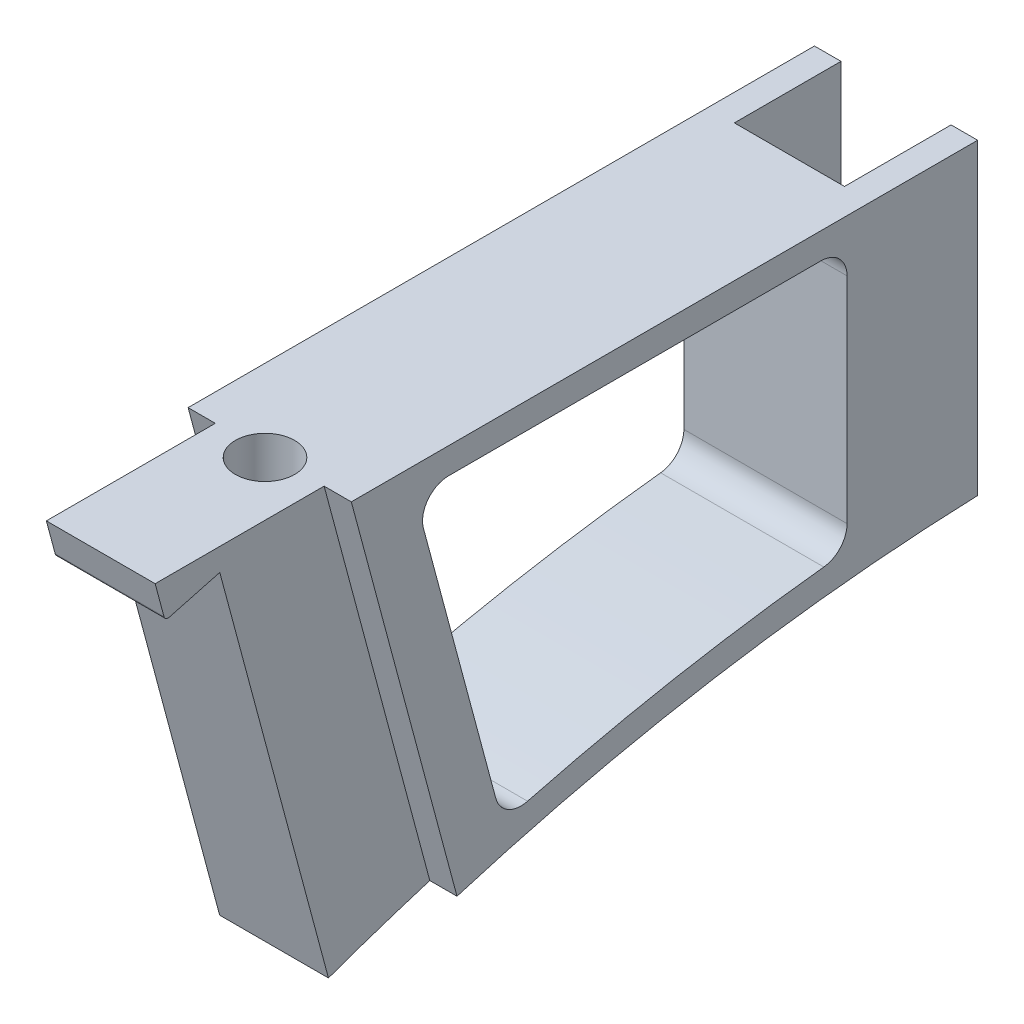
ISO-10303-21;
HEADER;
FILE_DESCRIPTION(('STEP AP214'),'2;1');
FILE_NAME('part.step','',(''),(''),'','','');
FILE_SCHEMA(('AUTOMOTIVE_DESIGN { 1 0 10303 214 1 1 1 1 }'));
ENDSEC;
DATA;
#1=APPLICATION_CONTEXT('core data for automotive mechanical design processes');
#2=APPLICATION_PROTOCOL_DEFINITION('international standard','automotive_design',2000,#1);
#3=PRODUCT_CONTEXT('',#1,'mechanical');
#4=PRODUCT('Part','Part','',(#3));
#5=PRODUCT_RELATED_PRODUCT_CATEGORY('part','',(#4));
#6=PRODUCT_DEFINITION_FORMATION('','',#4);
#7=PRODUCT_DEFINITION_CONTEXT('part definition',#1,'design');
#8=PRODUCT_DEFINITION('design','',#6,#7);
#9=PRODUCT_DEFINITION_SHAPE('','',#8);
#10=(LENGTH_UNIT() NAMED_UNIT(*) SI_UNIT(.MILLI.,.METRE.));
#11=(NAMED_UNIT(*) PLANE_ANGLE_UNIT() SI_UNIT($,.RADIAN.));
#12=(NAMED_UNIT(*) SI_UNIT($,.STERADIAN.) SOLID_ANGLE_UNIT());
#13=UNCERTAINTY_MEASURE_WITH_UNIT(LENGTH_MEASURE(1.E-05),#10,'distance_accuracy_value','');
#14=(GEOMETRIC_REPRESENTATION_CONTEXT(3) GLOBAL_UNCERTAINTY_ASSIGNED_CONTEXT((#13)) GLOBAL_UNIT_ASSIGNED_CONTEXT((#10,
#11,#12)) REPRESENTATION_CONTEXT('',''));
#15=CARTESIAN_POINT('',(0.,0.,0.));
#16=DIRECTION('',(0.,0.,1.));
#17=DIRECTION('',(1.,0.,0.));
#18=AXIS2_PLACEMENT_3D('',#15,#16,#17);
#19=CARTESIAN_POINT('',(4.7625,-136.886020449071,-28.9335540536376));
#20=DIRECTION('',(-1.,0.,0.));
#21=DIRECTION('',(0.,0.,1.));
#22=AXIS2_PLACEMENT_3D('',#19,#20,#21);
#23=CYLINDRICAL_SURFACE('',#22,119.);
#24=CARTESIAN_POINT('',(3.175,-136.886020449071,-28.9335540536376));
#25=DIRECTION('',(1.,0.,0.));
#26=DIRECTION('',(0.,0.,1.));
#27=AXIS2_PLACEMENT_3D('',#24,#25,#26);
#28=CIRCLE('',#27,119.);
#29=CARTESIAN_POINT('',(3.175,-23.0213439619458,5.64729973111368));
#30=VERTEX_POINT('',#29);
#31=CARTESIAN_POINT('',(3.175,-24.9885152456834,11.5627214449544));
#32=VERTEX_POINT('',#31);
#33=EDGE_CURVE('E268',#30,#32,#28,.T.);
#34=ORIENTED_EDGE('',*,*,#33,.T.);
#35=DIRECTION('',(1.,0.,0.));
#36=VECTOR('',#35,1.);
#37=CARTESIAN_POINT('',(-4.7625,-24.9885152456834,11.5627214449544));
#38=LINE('',#37,#36);
#39=CARTESIAN_POINT('',(-3.175,-24.9885152456834,11.5627214449544));
#40=VERTEX_POINT('',#39);
#41=EDGE_CURVE('E209',#40,#32,#38,.T.);
#42=ORIENTED_EDGE('',*,*,#41,.F.);
#43=CARTESIAN_POINT('',(-3.175,-136.886020449071,-28.9335540536376));
#44=DIRECTION('',(1.,0.,0.));
#45=DIRECTION('',(0.,0.,1.));
#46=AXIS2_PLACEMENT_3D('',#43,#44,#45);
#47=CIRCLE('',#46,119.);
#48=CARTESIAN_POINT('',(-3.175,-23.0213439619458,5.64729973111368));
#49=VERTEX_POINT('',#48);
#50=EDGE_CURVE('E247',#49,#40,#47,.T.);
#51=ORIENTED_EDGE('',*,*,#50,.F.);
#52=DIRECTION('',(-1.,0.,0.));
#53=VECTOR('',#52,1.);
#54=CARTESIAN_POINT('',(-3.175,-23.0213439619458,5.64729973111368));
#55=LINE('',#54,#53);
#56=CARTESIAN_POINT('',(-4.7625,-23.0213439619458,5.64729973111368));
#57=VERTEX_POINT('',#56);
#58=EDGE_CURVE('E259',#49,#57,#55,.T.);
#59=ORIENTED_EDGE('',*,*,#58,.T.);
#60=CARTESIAN_POINT('',(-4.7625,-136.886020449071,-28.9335540536376));
#61=DIRECTION('',(-1.,0.,0.));
#62=DIRECTION('',(0.,0.,-1.));
#63=AXIS2_PLACEMENT_3D('',#60,#61,#62);
#64=CIRCLE('',#63,119.);
#65=CARTESIAN_POINT('',(-4.7625,-17.9599388695447,-24.739854));
#66=VERTEX_POINT('',#65);
#67=EDGE_CURVE('E320',#57,#66,#64,.T.);
#68=ORIENTED_EDGE('',*,*,#67,.T.);
#69=DIRECTION('',(1.,0.,0.));
#70=VECTOR('',#69,1.);
#71=CARTESIAN_POINT('',(-24.1839645256634,-17.9599388695447,-24.739854));
#72=LINE('',#71,#70);
#73=CARTESIAN_POINT('',(-3.2131,-17.9599388695447,-24.739854));
#74=VERTEX_POINT('',#73);
#75=EDGE_CURVE('E312',#66,#74,#72,.T.);
#76=ORIENTED_EDGE('',*,*,#75,.T.);
#77=CARTESIAN_POINT('',(-3.21310000000001,-136.886020449071,-28.9335540536376));
#78=DIRECTION('',(-1.,0.,0.));
#79=DIRECTION('',(0.,-1.,0.));
#80=AXIS2_PLACEMENT_3D('',#77,#78,#79);
#81=CIRCLE('',#80,119.);
#82=CARTESIAN_POINT('',(-3.2131,-18.3428116178918,-18.516854));
#83=VERTEX_POINT('',#82);
#84=EDGE_CURVE('E290',#74,#83,#81,.F.);
#85=ORIENTED_EDGE('',*,*,#84,.T.);
#86=DIRECTION('',(-1.,0.,0.));
#87=VECTOR('',#86,1.);
#88=CARTESIAN_POINT('',(4.7625,-18.3428116178918,-18.516854));
#89=LINE('',#88,#87);
#90=CARTESIAN_POINT('',(3.2131,-18.3428116178918,-18.516854));
#91=VERTEX_POINT('',#90);
#92=EDGE_CURVE('E298',#91,#83,#89,.T.);
#93=ORIENTED_EDGE('',*,*,#92,.F.);
#94=CARTESIAN_POINT('',(3.21309999999998,-136.886020449071,-28.9335540536376));
#95=DIRECTION('',(1.,0.,0.));
#96=DIRECTION('',(0.,1.,0.));
#97=AXIS2_PLACEMENT_3D('',#94,#95,#96);
#98=CIRCLE('',#97,119.);
#99=CARTESIAN_POINT('',(3.2131,-17.9599388695447,-24.739854));
#100=VERTEX_POINT('',#99);
#101=EDGE_CURVE('E295',#91,#100,#98,.F.);
#102=ORIENTED_EDGE('',*,*,#101,.T.);
#103=CARTESIAN_POINT('',(4.7625,-17.9599388695447,-24.739854));
#104=VERTEX_POINT('',#103);
#105=EDGE_CURVE('E308',#100,#104,#72,.T.);
#106=ORIENTED_EDGE('',*,*,#105,.T.);
#107=CARTESIAN_POINT('',(4.7625,-136.886020449071,-28.9335540536376));
#108=DIRECTION('',(-1.,0.,0.));
#109=DIRECTION('',(0.,0.,-1.));
#110=AXIS2_PLACEMENT_3D('',#107,#108,#109);
#111=CIRCLE('',#110,119.);
#112=CARTESIAN_POINT('',(4.7625,-23.0213439619458,5.64729973111367));
#113=VERTEX_POINT('',#112);
#114=EDGE_CURVE('E321',#113,#104,#111,.T.);
#115=ORIENTED_EDGE('',*,*,#114,.F.);
#116=DIRECTION('',(1.,0.,0.));
#117=VECTOR('',#116,1.);
#118=CARTESIAN_POINT('',(3.175,-23.0213439619458,5.64729973111368));
#119=LINE('',#118,#117);
#120=EDGE_CURVE('E270',#30,#113,#119,.T.);
#121=ORIENTED_EDGE('',*,*,#120,.F.);
#122=EDGE_LOOP('',(#34,#42,#51,#59,#68,#76,#85,#93,#102,#106,#115,#121));
#123=FACE_BOUND('',#122,.T.);
#124=ADVANCED_FACE('F38',(#123),#23,.F.);
#125=CARTESIAN_POINT('',(4.7625,0.,18.389854));
#126=DIRECTION('',(0.,-1.,0.));
#127=DIRECTION('',(0.,0.,-1.));
#128=AXIS2_PLACEMENT_3D('',#125,#126,#127);
#129=PLANE('',#128);
#130=CARTESIAN_POINT('',(0.,0.,12.090146));
#131=DIRECTION('',(0.,1.,0.));
#132=DIRECTION('',(0.,0.,1.));
#133=AXIS2_PLACEMENT_3D('',#130,#131,#132);
#134=CIRCLE('',#133,1.7272);
#135=CARTESIAN_POINT('',(0.,0.,13.817346));
#136=VERTEX_POINT('',#135);
#137=EDGE_CURVE('E304',#136,#136,#134,.T.);
#138=ORIENTED_EDGE('',*,*,#137,.F.);
#139=EDGE_LOOP('',(#138));
#140=FACE_BOUND('',#139,.T.);
#141=DIRECTION('',(0.,0.,1.));
#142=VECTOR('',#141,1.);
#143=CARTESIAN_POINT('',(-4.7625,0.,18.389854));
#144=LINE('',#143,#142);
#145=CARTESIAN_POINT('',(-4.7625,0.,-24.739854));
#146=VERTEX_POINT('',#145);
#147=CARTESIAN_POINT('',(-4.7625,0.,11.815850254396));
#148=VERTEX_POINT('',#147);
#149=EDGE_CURVE('E324',#146,#148,#144,.T.);
#150=ORIENTED_EDGE('',*,*,#149,.T.);
#151=DIRECTION('',(-1.,0.,0.));
#152=VECTOR('',#151,1.);
#153=CARTESIAN_POINT('',(-3.175,0.,11.815850254396));
#154=LINE('',#153,#152);
#155=CARTESIAN_POINT('',(-3.175,0.,11.815850254396));
#156=VERTEX_POINT('',#155);
#157=EDGE_CURVE('E256',#156,#148,#154,.T.);
#158=ORIENTED_EDGE('',*,*,#157,.F.);
#159=DIRECTION('',(0.,0.,-1.));
#160=VECTOR('',#159,1.);
#161=CARTESIAN_POINT('',(-3.175,0.,18.389854));
#162=LINE('',#161,#160);
#163=CARTESIAN_POINT('',(-3.175,0.,21.676855872802));
#164=VERTEX_POINT('',#163);
#165=EDGE_CURVE('E253',#164,#156,#162,.T.);
#166=ORIENTED_EDGE('',*,*,#165,.F.);
#167=DIRECTION('',(1.,0.,0.));
#168=VECTOR('',#167,1.);
#169=CARTESIAN_POINT('',(-3.175,0.,21.676855872802));
#170=LINE('',#169,#168);
#171=CARTESIAN_POINT('',(3.175,0.,21.676855872802));
#172=VERTEX_POINT('',#171);
#173=EDGE_CURVE('E219',#164,#172,#170,.T.);
#174=ORIENTED_EDGE('',*,*,#173,.T.);
#175=DIRECTION('',(0.,0.,-1.));
#176=VECTOR('',#175,1.);
#177=CARTESIAN_POINT('',(3.175,0.,18.389854));
#178=LINE('',#177,#176);
#179=CARTESIAN_POINT('',(3.175,0.,11.815850254396));
#180=VERTEX_POINT('',#179);
#181=EDGE_CURVE('E263',#172,#180,#178,.T.);
#182=ORIENTED_EDGE('',*,*,#181,.T.);
#183=DIRECTION('',(1.,0.,0.));
#184=VECTOR('',#183,1.);
#185=CARTESIAN_POINT('',(3.175,0.,11.815850254396));
#186=LINE('',#185,#184);
#187=CARTESIAN_POINT('',(4.7625,0.,11.815850254396));
#188=VERTEX_POINT('',#187);
#189=EDGE_CURVE('E274',#180,#188,#186,.T.);
#190=ORIENTED_EDGE('',*,*,#189,.T.);
#191=DIRECTION('',(0.,0.,1.));
#192=VECTOR('',#191,1.);
#193=CARTESIAN_POINT('',(4.7625,0.,18.389854));
#194=LINE('',#193,#192);
#195=CARTESIAN_POINT('',(4.7625,0.,-24.739854));
#196=VERTEX_POINT('',#195);
#197=EDGE_CURVE('E323',#196,#188,#194,.T.);
#198=ORIENTED_EDGE('',*,*,#197,.F.);
#199=DIRECTION('',(1.,0.,0.));
#200=VECTOR('',#199,1.);
#201=CARTESIAN_POINT('',(-24.1839645256634,0.,-24.739854));
#202=LINE('',#201,#200);
#203=CARTESIAN_POINT('',(3.2131,0.,-24.739854));
#204=VERTEX_POINT('',#203);
#205=EDGE_CURVE('E311',#204,#196,#202,.T.);
#206=ORIENTED_EDGE('',*,*,#205,.F.);
#207=DIRECTION('',(0.,0.,-1.));
#208=VECTOR('',#207,1.);
#209=CARTESIAN_POINT('',(3.2131,0.,-18.516854));
#210=LINE('',#209,#208);
#211=CARTESIAN_POINT('',(3.2131,0.,-18.516854));
#212=VERTEX_POINT('',#211);
#213=EDGE_CURVE('E288',#212,#204,#210,.T.);
#214=ORIENTED_EDGE('',*,*,#213,.F.);
#215=DIRECTION('',(1.,0.,0.));
#216=VECTOR('',#215,1.);
#217=CARTESIAN_POINT('',(3.2131,0.,-18.516854));
#218=LINE('',#217,#216);
#219=CARTESIAN_POINT('',(-3.2131,0.,-18.516854));
#220=VERTEX_POINT('',#219);
#221=EDGE_CURVE('E283',#220,#212,#218,.T.);
#222=ORIENTED_EDGE('',*,*,#221,.F.);
#223=DIRECTION('',(0.,0.,-1.));
#224=VECTOR('',#223,1.);
#225=CARTESIAN_POINT('',(-3.2131,0.,-18.516854));
#226=LINE('',#225,#224);
#227=CARTESIAN_POINT('',(-3.2131,0.,-24.739854));
#228=VERTEX_POINT('',#227);
#229=EDGE_CURVE('E286',#220,#228,#226,.T.);
#230=ORIENTED_EDGE('',*,*,#229,.T.);
#231=EDGE_CURVE('E305',#146,#228,#202,.T.);
#232=ORIENTED_EDGE('',*,*,#231,.F.);
#233=EDGE_LOOP('',(#150,#158,#166,#174,#182,#190,#198,#206,#214,#222,#230,#232));
#234=FACE_BOUND('',#233,.T.);
#235=ADVANCED_FACE('F395',(#140,#234),#129,.F.);
#236=CARTESIAN_POINT('',(4.7625,-136.886020449071,-28.9335540536376));
#237=DIRECTION('',(1.,0.,0.));
#238=DIRECTION('',(0.,0.,-1.));
#239=AXIS2_PLACEMENT_3D('',#236,#237,#238);
#240=PLANE('',#239);
#241=DIRECTION('',(0.,-0.96592582628907,-0.258819045102514));
#242=VECTOR('',#241,1.);
#243=CARTESIAN_POINT('',(4.7625,-20.6670496227549,2.99112912524303));
#244=LINE('',#243,#242);
#245=CARTESIAN_POINT('',(4.7625,-3.44244022473624,7.60644930338352));
#246=VERTEX_POINT('',#245);
#247=CARTESIAN_POINT('',(4.7625,-19.1950079553788,3.38556150124139));
#248=VERTEX_POINT('',#247);
#249=EDGE_CURVE('E222',#246,#248,#244,.T.);
#250=ORIENTED_EDGE('',*,*,#249,.F.);
#251=CARTESIAN_POINT('',(4.7625,-3.04800000000001,6.13437834411898));
#252=DIRECTION('',(1.,0.,0.));
#253=DIRECTION('',(0.,0.,-1.));
#254=AXIS2_PLACEMENT_3D('',#251,#252,#253);
#255=CIRCLE('',#254,1.524);
#256=CARTESIAN_POINT('',(4.7625,-1.524,6.13437834411898));
#257=VERTEX_POINT('',#256);
#258=EDGE_CURVE('E364',#246,#257,#255,.F.);
#259=ORIENTED_EDGE('',*,*,#258,.T.);
#260=DIRECTION('',(0.,0.,1.));
#261=VECTOR('',#260,1.);
#262=CARTESIAN_POINT('',(4.7625,-1.524,8.12049381232896));
#263=LINE('',#262,#261);
#264=CARTESIAN_POINT('',(4.7625,-1.524,-15.595854));
#265=VERTEX_POINT('',#264);
#266=EDGE_CURVE('E231',#265,#257,#263,.T.);
#267=ORIENTED_EDGE('',*,*,#266,.F.);
#268=CARTESIAN_POINT('',(4.7625,-3.048,-15.595854));
#269=DIRECTION('',(1.,0.,0.));
#270=DIRECTION('',(0.,0.,-1.));
#271=AXIS2_PLACEMENT_3D('',#268,#269,#270);
#272=CIRCLE('',#271,1.524);
#273=CARTESIAN_POINT('',(4.7625,-3.048,-17.119854));
#274=VERTEX_POINT('',#273);
#275=EDGE_CURVE('E360',#265,#274,#272,.F.);
#276=ORIENTED_EDGE('',*,*,#275,.T.);
#277=DIRECTION('',(0.,1.,0.));
#278=VECTOR('',#277,1.);
#279=CARTESIAN_POINT('',(4.7625,-1.524,-17.119854));
#280=LINE('',#279,#278);
#281=CARTESIAN_POINT('',(4.7625,-15.5689974832926,-17.119854));
#282=VERTEX_POINT('',#281);
#283=EDGE_CURVE('E228',#282,#274,#280,.T.);
#284=ORIENTED_EDGE('',*,*,#283,.F.);
#285=CARTESIAN_POINT('',(4.7625,-15.5689974832926,-15.595854));
#286=DIRECTION('',(1.,0.,0.));
#287=DIRECTION('',(0.,0.,-1.));
#288=AXIS2_PLACEMENT_3D('',#285,#286,#287);
#289=CIRCLE('',#288,1.524);
#290=CARTESIAN_POINT('',(4.7625,-17.0838698531785,-15.7624003988082));
#291=VERTEX_POINT('',#290);
#292=EDGE_CURVE('E356',#282,#291,#289,.F.);
#293=ORIENTED_EDGE('',*,*,#292,.T.);
#294=CARTESIAN_POINT('',(4.7625,-136.886020449071,-28.9335540536376));
#295=DIRECTION('',(-1.,0.,0.));
#296=DIRECTION('',(0.,0.,-1.));
#297=AXIS2_PLACEMENT_3D('',#294,#295,#296);
#298=CIRCLE('',#297,120.524);
#299=CARTESIAN_POINT('',(4.7625,-20.2750878370178,1.52830687683105));
#300=VERTEX_POINT('',#299);
#301=EDGE_CURVE('E225',#300,#291,#298,.T.);
#302=ORIENTED_EDGE('',*,*,#301,.F.);
#303=CARTESIAN_POINT('',(4.7625,-18.8005677306426,1.91349054197685));
#304=DIRECTION('',(1.,0.,0.));
#305=DIRECTION('',(0.,0.,-1.));
#306=AXIS2_PLACEMENT_3D('',#303,#304,#305);
#307=CIRCLE('',#306,1.524);
#308=EDGE_CURVE('E352',#300,#248,#307,.F.);
#309=ORIENTED_EDGE('',*,*,#308,.T.);
#310=EDGE_LOOP('',(#250,#259,#267,#276,#284,#293,#302,#309));
#311=FACE_BOUND('',#310,.T.);
#312=ORIENTED_EDGE('',*,*,#197,.T.);
#313=DIRECTION('',(0.,-0.96592582628907,-0.258819045102514));
#314=VECTOR('',#313,1.);
#315=CARTESIAN_POINT('',(4.7625,0.,11.815850254396));
#316=LINE('',#315,#314);
#317=EDGE_CURVE('E262',#188,#113,#316,.T.);
#318=ORIENTED_EDGE('',*,*,#317,.T.);
#319=ORIENTED_EDGE('',*,*,#114,.T.);
#320=DIRECTION('',(0.,1.,0.));
#321=VECTOR('',#320,1.);
#322=CARTESIAN_POINT('',(4.7625,0.,-24.739854));
#323=LINE('',#322,#321);
#324=EDGE_CURVE('E300',#104,#196,#323,.T.);
#325=ORIENTED_EDGE('',*,*,#324,.T.);
#326=EDGE_LOOP('',(#312,#318,#319,#325));
#327=FACE_BOUND('',#326,.T.);
#328=ADVANCED_FACE('F401',(#311,#327),#240,.T.);
#329=CARTESIAN_POINT('',(-24.1839645256634,0.,-24.739854));
#330=DIRECTION('',(0.,0.,-1.));
#331=DIRECTION('',(0.,1.,0.));
#332=AXIS2_PLACEMENT_3D('',#329,#330,#331);
#333=PLANE('',#332);
#334=DIRECTION('',(0.,-1.,0.));
#335=VECTOR('',#334,1.);
#336=CARTESIAN_POINT('',(3.2131,0.,-24.739854));
#337=LINE('',#336,#335);
#338=EDGE_CURVE('E277',#204,#100,#337,.T.);
#339=ORIENTED_EDGE('',*,*,#338,.F.);
#340=ORIENTED_EDGE('',*,*,#205,.T.);
#341=ORIENTED_EDGE('',*,*,#324,.F.);
#342=ORIENTED_EDGE('',*,*,#105,.F.);
#343=EDGE_LOOP('',(#339,#340,#341,#342));
#344=FACE_BOUND('',#343,.T.);
#345=ADVANCED_FACE('F458',(#344),#333,.T.);
#346=CARTESIAN_POINT('',(-4.7625,-136.886020449071,-28.9335540536376));
#347=DIRECTION('',(1.,0.,0.));
#348=DIRECTION('',(0.,0.,-1.));
#349=AXIS2_PLACEMENT_3D('',#346,#347,#348);
#350=PLANE('',#349);
#351=DIRECTION('',(0.,1.,0.));
#352=VECTOR('',#351,1.);
#353=CARTESIAN_POINT('',(-4.7625,-1.524,-17.119854));
#354=LINE('',#353,#352);
#355=CARTESIAN_POINT('',(-4.7625,-15.5689974832926,-17.119854));
#356=VERTEX_POINT('',#355);
#357=CARTESIAN_POINT('',(-4.7625,-3.048,-17.119854));
#358=VERTEX_POINT('',#357);
#359=EDGE_CURVE('E240',#356,#358,#354,.T.);
#360=ORIENTED_EDGE('',*,*,#359,.T.);
#361=CARTESIAN_POINT('',(-4.7625,-3.048,-15.595854));
#362=DIRECTION('',(1.,0.,0.));
#363=DIRECTION('',(0.,0.,-1.));
#364=AXIS2_PLACEMENT_3D('',#361,#362,#363);
#365=CIRCLE('',#364,1.524);
#366=CARTESIAN_POINT('',(-4.7625,-1.524,-15.595854));
#367=VERTEX_POINT('',#366);
#368=EDGE_CURVE('E362',#358,#367,#365,.T.);
#369=ORIENTED_EDGE('',*,*,#368,.T.);
#370=DIRECTION('',(0.,0.,1.));
#371=VECTOR('',#370,1.);
#372=CARTESIAN_POINT('',(-4.7625,-1.524,8.12049381232896));
#373=LINE('',#372,#371);
#374=CARTESIAN_POINT('',(-4.7625,-1.524,6.13437834411898));
#375=VERTEX_POINT('',#374);
#376=EDGE_CURVE('E243',#367,#375,#373,.T.);
#377=ORIENTED_EDGE('',*,*,#376,.T.);
#378=CARTESIAN_POINT('',(-4.7625,-3.04800000000001,6.13437834411898));
#379=DIRECTION('',(1.,0.,0.));
#380=DIRECTION('',(0.,0.,-1.));
#381=AXIS2_PLACEMENT_3D('',#378,#379,#380);
#382=CIRCLE('',#381,1.524);
#383=CARTESIAN_POINT('',(-4.7625,-3.44244022473624,7.60644930338352));
#384=VERTEX_POINT('',#383);
#385=EDGE_CURVE('E366',#375,#384,#382,.T.);
#386=ORIENTED_EDGE('',*,*,#385,.T.);
#387=DIRECTION('',(0.,-0.96592582628907,-0.258819045102514));
#388=VECTOR('',#387,1.);
#389=CARTESIAN_POINT('',(-4.7625,-20.6670496227549,2.99112912524303));
#390=LINE('',#389,#388);
#391=CARTESIAN_POINT('',(-4.7625,-19.1950079553788,3.38556150124139));
#392=VERTEX_POINT('',#391);
#393=EDGE_CURVE('E234',#384,#392,#390,.T.);
#394=ORIENTED_EDGE('',*,*,#393,.T.);
#395=CARTESIAN_POINT('',(-4.7625,-18.8005677306426,1.91349054197685));
#396=DIRECTION('',(1.,0.,0.));
#397=DIRECTION('',(0.,0.,-1.));
#398=AXIS2_PLACEMENT_3D('',#395,#396,#397);
#399=CIRCLE('',#398,1.524);
#400=CARTESIAN_POINT('',(-4.7625,-20.2750878370178,1.52830687683105));
#401=VERTEX_POINT('',#400);
#402=EDGE_CURVE('E354',#392,#401,#399,.T.);
#403=ORIENTED_EDGE('',*,*,#402,.T.);
#404=CARTESIAN_POINT('',(-4.7625,-136.886020449071,-28.9335540536376));
#405=DIRECTION('',(-1.,0.,0.));
#406=DIRECTION('',(0.,0.,-1.));
#407=AXIS2_PLACEMENT_3D('',#404,#405,#406);
#408=CIRCLE('',#407,120.524);
#409=CARTESIAN_POINT('',(-4.7625,-17.0838698531785,-15.7624003988082));
#410=VERTEX_POINT('',#409);
#411=EDGE_CURVE('E237',#401,#410,#408,.T.);
#412=ORIENTED_EDGE('',*,*,#411,.T.);
#413=CARTESIAN_POINT('',(-4.7625,-15.5689974832926,-15.595854));
#414=DIRECTION('',(1.,0.,0.));
#415=DIRECTION('',(0.,0.,-1.));
#416=AXIS2_PLACEMENT_3D('',#413,#414,#415);
#417=CIRCLE('',#416,1.524);
#418=EDGE_CURVE('E358',#410,#356,#417,.T.);
#419=ORIENTED_EDGE('',*,*,#418,.T.);
#420=EDGE_LOOP('',(#360,#369,#377,#386,#394,#403,#412,#419));
#421=FACE_BOUND('',#420,.T.);
#422=ORIENTED_EDGE('',*,*,#67,.F.);
#423=DIRECTION('',(0.,-0.96592582628907,-0.258819045102514));
#424=VECTOR('',#423,1.);
#425=CARTESIAN_POINT('',(-4.7625,0.,11.815850254396));
#426=LINE('',#425,#424);
#427=EDGE_CURVE('E246',#148,#57,#426,.T.);
#428=ORIENTED_EDGE('',*,*,#427,.F.);
#429=ORIENTED_EDGE('',*,*,#149,.F.);
#430=DIRECTION('',(0.,-1.,0.));
#431=VECTOR('',#430,1.);
#432=CARTESIAN_POINT('',(-4.7625,0.,-24.739854));
#433=LINE('',#432,#431);
#434=EDGE_CURVE('E301',#146,#66,#433,.T.);
#435=ORIENTED_EDGE('',*,*,#434,.T.);
#436=EDGE_LOOP('',(#422,#428,#429,#435));
#437=FACE_BOUND('',#436,.T.);
#438=ADVANCED_FACE('F430',(#421,#437),#350,.F.);
#439=CARTESIAN_POINT('',(0.,-8.89,12.090146));
#440=DIRECTION('',(0.,1.,0.));
#441=DIRECTION('',(0.,0.,1.));
#442=AXIS2_PLACEMENT_3D('',#439,#440,#441);
#443=CONICAL_SURFACE('',#442,1.7272,1.02974425867665);
#444=CARTESIAN_POINT('',(0.,-9.9278064611844,12.090146));
#445=VERTEX_POINT('',#444);
#446=VERTEX_LOOP('',#445);
#447=FACE_BOUND('',#446,.T.);
#448=CARTESIAN_POINT('',(0.,-8.89,12.090146));
#449=DIRECTION('',(0.,1.,0.));
#450=DIRECTION('',(0.,0.,1.));
#451=AXIS2_PLACEMENT_3D('',#448,#449,#450);
#452=CIRCLE('',#451,1.7272);
#453=CARTESIAN_POINT('',(0.,-8.89,13.817346));
#454=VERTEX_POINT('',#453);
#455=EDGE_CURVE('E317',#454,#454,#452,.T.);
#456=ORIENTED_EDGE('',*,*,#455,.T.);
#457=EDGE_LOOP('',(#456));
#458=FACE_BOUND('',#457,.T.);
#459=ADVANCED_FACE('F519',(#447,#458),#443,.F.);
#460=CARTESIAN_POINT('',(0.,0.,12.090146));
#461=DIRECTION('',(0.,1.,0.));
#462=DIRECTION('',(0.,0.,1.));
#463=AXIS2_PLACEMENT_3D('',#460,#461,#462);
#464=CYLINDRICAL_SURFACE('',#463,1.7272);
#465=ORIENTED_EDGE('',*,*,#455,.F.);
#466=EDGE_LOOP('',(#465));
#467=FACE_BOUND('',#466,.T.);
#468=ORIENTED_EDGE('',*,*,#137,.T.);
#469=EDGE_LOOP('',(#468));
#470=FACE_BOUND('',#469,.T.);
#471=ADVANCED_FACE('F516',(#467,#470),#464,.F.);
#472=DIRECTION('',(0.,1.,0.));
#473=VECTOR('',#472,1.);
#474=CARTESIAN_POINT('',(-3.2131,0.,-24.739854));
#475=LINE('',#474,#473);
#476=EDGE_CURVE('E327',#74,#228,#475,.T.);
#477=ORIENTED_EDGE('',*,*,#476,.F.);
#478=ORIENTED_EDGE('',*,*,#75,.F.);
#479=ORIENTED_EDGE('',*,*,#434,.F.);
#480=ORIENTED_EDGE('',*,*,#231,.T.);
#481=EDGE_LOOP('',(#477,#478,#479,#480));
#482=FACE_BOUND('',#481,.T.);
#483=ADVANCED_FACE('F488',(#482),#333,.T.);
#484=CARTESIAN_POINT('',(3.2131,-22.225,-18.516854));
#485=DIRECTION('',(0.,0.,-1.));
#486=DIRECTION('',(0.,1.,0.));
#487=AXIS2_PLACEMENT_3D('',#484,#485,#486);
#488=PLANE('',#487);
#489=ORIENTED_EDGE('',*,*,#92,.T.);
#490=DIRECTION('',(0.,1.,0.));
#491=VECTOR('',#490,1.);
#492=CARTESIAN_POINT('',(-3.2131,0.,-18.516854));
#493=LINE('',#492,#491);
#494=EDGE_CURVE('E281',#83,#220,#493,.T.);
#495=ORIENTED_EDGE('',*,*,#494,.T.);
#496=ORIENTED_EDGE('',*,*,#221,.T.);
#497=DIRECTION('',(0.,-1.,0.));
#498=VECTOR('',#497,1.);
#499=CARTESIAN_POINT('',(3.2131,0.,-18.516854));
#500=LINE('',#499,#498);
#501=EDGE_CURVE('E278',#212,#91,#500,.T.);
#502=ORIENTED_EDGE('',*,*,#501,.T.);
#503=EDGE_LOOP('',(#489,#495,#496,#502));
#504=FACE_BOUND('',#503,.T.);
#505=ADVANCED_FACE('F481',(#504),#488,.T.);
#506=CARTESIAN_POINT('',(3.2131,0.,-18.516854));
#507=DIRECTION('',(1.,0.,0.));
#508=DIRECTION('',(0.,1.,0.));
#509=AXIS2_PLACEMENT_3D('',#506,#507,#508);
#510=PLANE('',#509);
#511=ORIENTED_EDGE('',*,*,#501,.F.);
#512=ORIENTED_EDGE('',*,*,#213,.T.);
#513=ORIENTED_EDGE('',*,*,#338,.T.);
#514=ORIENTED_EDGE('',*,*,#101,.F.);
#515=EDGE_LOOP('',(#511,#512,#513,#514));
#516=FACE_BOUND('',#515,.T.);
#517=ADVANCED_FACE('F476',(#516),#510,.F.);
#518=CARTESIAN_POINT('',(-3.2131,0.,-18.516854));
#519=DIRECTION('',(-1.,0.,0.));
#520=DIRECTION('',(0.,-1.,0.));
#521=AXIS2_PLACEMENT_3D('',#518,#519,#520);
#522=PLANE('',#521);
#523=ORIENTED_EDGE('',*,*,#476,.T.);
#524=ORIENTED_EDGE('',*,*,#229,.F.);
#525=ORIENTED_EDGE('',*,*,#494,.F.);
#526=ORIENTED_EDGE('',*,*,#84,.F.);
#527=EDGE_LOOP('',(#523,#524,#525,#526));
#528=FACE_BOUND('',#527,.T.);
#529=ADVANCED_FACE('F484',(#528),#522,.F.);
#530=CARTESIAN_POINT('',(3.175,0.,11.815850254396));
#531=DIRECTION('',(0.,-0.258819045102514,0.96592582628907));
#532=DIRECTION('',(0.,-0.96592582628907,-0.258819045102514));
#533=AXIS2_PLACEMENT_3D('',#530,#531,#532);
#534=PLANE('',#533);
#535=ORIENTED_EDGE('',*,*,#317,.F.);
#536=ORIENTED_EDGE('',*,*,#189,.F.);
#537=DIRECTION('',(0.,-0.96592582628907,-0.258819045102514));
#538=VECTOR('',#537,1.);
#539=CARTESIAN_POINT('',(3.175,0.,11.815850254396));
#540=LINE('',#539,#538);
#541=EDGE_CURVE('E266',#180,#30,#540,.T.);
#542=ORIENTED_EDGE('',*,*,#541,.T.);
#543=ORIENTED_EDGE('',*,*,#120,.T.);
#544=EDGE_LOOP('',(#535,#536,#542,#543));
#545=FACE_BOUND('',#544,.T.);
#546=ADVANCED_FACE('F468',(#545),#534,.T.);
#547=CARTESIAN_POINT('',(3.175,-136.886020449071,-28.9335540536376));
#548=DIRECTION('',(-1.,0.,0.));
#549=DIRECTION('',(0.,0.,1.));
#550=AXIS2_PLACEMENT_3D('',#547,#548,#549);
#551=PLANE('',#550);
#552=DIRECTION('',(0.,0.258819045102515,-0.96592582628907));
#553=VECTOR('',#552,1.);
#554=CARTESIAN_POINT('',(3.175,-2.17114884752631,21.0950982924596));
#555=LINE('',#554,#553);
#556=CARTESIAN_POINT('',(3.175,-2.10540881007028,20.8497531325822));
#557=VERTEX_POINT('',#556);
#558=CARTESIAN_POINT('',(3.175,-1.31652836059781,17.9056112140531));
#559=VERTEX_POINT('',#558);
#560=EDGE_CURVE('E194',#557,#559,#555,.T.);
#561=ORIENTED_EDGE('',*,*,#560,.T.);
#562=DIRECTION('',(0.,0.96592582628907,0.258819045102515));
#563=VECTOR('',#562,1.);
#564=CARTESIAN_POINT('',(3.175,-24.9885152456833,11.5627214449544));
#565=LINE('',#564,#563);
#566=EDGE_CURVE('E199',#32,#559,#565,.T.);
#567=ORIENTED_EDGE('',*,*,#566,.F.);
#568=ORIENTED_EDGE('',*,*,#33,.F.);
#569=ORIENTED_EDGE('',*,*,#541,.F.);
#570=ORIENTED_EDGE('',*,*,#181,.F.);
#571=DIRECTION('',(0.,-0.96592582628907,-0.258819045102514));
#572=VECTOR('',#571,1.);
#573=CARTESIAN_POINT('',(3.175,0.,21.676855872802));
#574=LINE('',#573,#572);
#575=CARTESIAN_POINT('',(3.175,-1.92580368764889,21.1608383299156));
#576=VERTEX_POINT('',#575);
#577=EDGE_CURVE('E202',#172,#576,#574,.T.);
#578=ORIENTED_EDGE('',*,*,#577,.T.);
#579=CARTESIAN_POINT('',(3.175,-1.86006365019285,20.9154931700382));
#580=DIRECTION('',(-1.,0.,0.));
#581=DIRECTION('',(0.,0.,1.));
#582=AXIS2_PLACEMENT_3D('',#579,#580,#581);
#583=CIRCLE('',#582,0.254);
#584=EDGE_CURVE('E61',#576,#557,#583,.F.);
#585=ORIENTED_EDGE('',*,*,#584,.T.);
#586=EDGE_LOOP('',(#561,#567,#568,#569,#570,#578,#585));
#587=FACE_BOUND('',#586,.T.);
#588=ADVANCED_FACE('F196',(#587),#551,.F.);
#589=CARTESIAN_POINT('',(-3.175,0.,11.815850254396));
#590=DIRECTION('',(0.,0.258819045102514,-0.96592582628907));
#591=DIRECTION('',(0.,0.96592582628907,0.258819045102514));
#592=AXIS2_PLACEMENT_3D('',#589,#590,#591);
#593=PLANE('',#592);
#594=ORIENTED_EDGE('',*,*,#427,.T.);
#595=ORIENTED_EDGE('',*,*,#58,.F.);
#596=DIRECTION('',(0.,-0.96592582628907,-0.258819045102514));
#597=VECTOR('',#596,1.);
#598=CARTESIAN_POINT('',(-3.175,0.,11.815850254396));
#599=LINE('',#598,#597);
#600=EDGE_CURVE('E250',#156,#49,#599,.T.);
#601=ORIENTED_EDGE('',*,*,#600,.F.);
#602=ORIENTED_EDGE('',*,*,#157,.T.);
#603=EDGE_LOOP('',(#594,#595,#601,#602));
#604=FACE_BOUND('',#603,.T.);
#605=ADVANCED_FACE('F495',(#604),#593,.F.);
#606=CARTESIAN_POINT('',(-3.175,-136.886020449071,-28.9335540536376));
#607=DIRECTION('',(1.,0.,0.));
#608=DIRECTION('',(0.,0.,1.));
#609=AXIS2_PLACEMENT_3D('',#606,#607,#608);
#610=PLANE('',#609);
#611=ORIENTED_EDGE('',*,*,#50,.T.);
#612=DIRECTION('',(0.,0.96592582628907,0.258819045102515));
#613=VECTOR('',#612,1.);
#614=CARTESIAN_POINT('',(-3.175,-139.514377785143,-19.1243909349708));
#615=LINE('',#614,#613);
#616=CARTESIAN_POINT('',(-3.175,-1.31652836059781,17.9056112140531));
#617=VERTEX_POINT('',#616);
#618=EDGE_CURVE('E11',#40,#617,#615,.T.);
#619=ORIENTED_EDGE('',*,*,#618,.T.);
#620=DIRECTION('',(0.,0.258819045102515,-0.96592582628907));
#621=VECTOR('',#620,1.);
#622=CARTESIAN_POINT('',(-3.175,-2.17114884752631,21.0950982924596));
#623=LINE('',#622,#621);
#624=CARTESIAN_POINT('',(-3.175,-2.10540881007028,20.8497531325822));
#625=VERTEX_POINT('',#624);
#626=EDGE_CURVE('E207',#625,#617,#623,.T.);
#627=ORIENTED_EDGE('',*,*,#626,.F.);
#628=CARTESIAN_POINT('',(-3.175,-1.86006365019285,20.9154931700382));
#629=DIRECTION('',(1.,0.,0.));
#630=DIRECTION('',(0.,0.,-1.));
#631=AXIS2_PLACEMENT_3D('',#628,#629,#630);
#632=CIRCLE('',#631,0.254);
#633=CARTESIAN_POINT('',(-3.175,-1.92580368764889,21.1608383299156));
#634=VERTEX_POINT('',#633);
#635=EDGE_CURVE('E46',#625,#634,#632,.F.);
#636=ORIENTED_EDGE('',*,*,#635,.T.);
#637=DIRECTION('',(0.,-0.96592582628907,-0.258819045102514));
#638=VECTOR('',#637,1.);
#639=CARTESIAN_POINT('',(-3.175,0.,21.676855872802));
#640=LINE('',#639,#638);
#641=EDGE_CURVE('E201',#164,#634,#640,.T.);
#642=ORIENTED_EDGE('',*,*,#641,.F.);
#643=ORIENTED_EDGE('',*,*,#165,.T.);
#644=ORIENTED_EDGE('',*,*,#600,.T.);
#645=EDGE_LOOP('',(#611,#619,#627,#636,#642,#643,#644));
#646=FACE_BOUND('',#645,.T.);
#647=ADVANCED_FACE('F379',(#646),#610,.F.);
#648=CARTESIAN_POINT('',(-4.7625,-20.6670496227549,2.99112912524303));
#649=DIRECTION('',(0.,-0.258819045102514,0.96592582628907));
#650=DIRECTION('',(0.,-0.96592582628907,-0.258819045102514));
#651=AXIS2_PLACEMENT_3D('',#648,#649,#650);
#652=PLANE('',#651);
#653=ORIENTED_EDGE('',*,*,#249,.T.);
#654=DIRECTION('',(-1.,0.,0.));
#655=VECTOR('',#654,1.);
#656=CARTESIAN_POINT('',(-4.7625,-19.1950079553788,3.38556150124139));
#657=LINE('',#656,#655);
#658=EDGE_CURVE('E340',#248,#392,#657,.T.);
#659=ORIENTED_EDGE('',*,*,#658,.T.);
#660=ORIENTED_EDGE('',*,*,#393,.F.);
#661=DIRECTION('',(1.,0.,0.));
#662=VECTOR('',#661,1.);
#663=CARTESIAN_POINT('',(4.7625,-3.44244022473624,7.60644930338352));
#664=LINE('',#663,#662);
#665=EDGE_CURVE('E337',#384,#246,#664,.T.);
#666=ORIENTED_EDGE('',*,*,#665,.T.);
#667=EDGE_LOOP('',(#653,#659,#660,#666));
#668=FACE_BOUND('',#667,.T.);
#669=ADVANCED_FACE('F435',(#668),#652,.F.);
#670=CARTESIAN_POINT('',(-4.7625,-1.524,8.12049381232896));
#671=DIRECTION('',(0.,1.,0.));
#672=DIRECTION('',(0.,0.,1.));
#673=AXIS2_PLACEMENT_3D('',#670,#671,#672);
#674=PLANE('',#673);
#675=ORIENTED_EDGE('',*,*,#376,.F.);
#676=DIRECTION('',(1.,0.,0.));
#677=VECTOR('',#676,1.);
#678=CARTESIAN_POINT('',(4.7625,-1.524,-15.595854));
#679=LINE('',#678,#677);
#680=EDGE_CURVE('E349',#367,#265,#679,.T.);
#681=ORIENTED_EDGE('',*,*,#680,.T.);
#682=ORIENTED_EDGE('',*,*,#266,.T.);
#683=DIRECTION('',(1.,0.,0.));
#684=VECTOR('',#683,1.);
#685=CARTESIAN_POINT('',(-4.7625,-1.524,6.13437834411898));
#686=LINE('',#685,#684);
#687=EDGE_CURVE('E347',#257,#375,#686,.F.);
#688=ORIENTED_EDGE('',*,*,#687,.T.);
#689=EDGE_LOOP('',(#675,#681,#682,#688));
#690=FACE_BOUND('',#689,.T.);
#691=ADVANCED_FACE('F453',(#690),#674,.F.);
#692=CARTESIAN_POINT('',(-4.7625,-1.524,-17.119854));
#693=DIRECTION('',(0.,0.,-1.));
#694=DIRECTION('',(-1.,0.,0.));
#695=AXIS2_PLACEMENT_3D('',#692,#693,#694);
#696=PLANE('',#695);
#697=ORIENTED_EDGE('',*,*,#359,.F.);
#698=DIRECTION('',(-1.,0.,0.));
#699=VECTOR('',#698,1.);
#700=CARTESIAN_POINT('',(4.7625,-15.5689974832926,-17.119854));
#701=LINE('',#700,#699);
#702=EDGE_CURVE('E344',#356,#282,#701,.F.);
#703=ORIENTED_EDGE('',*,*,#702,.T.);
#704=ORIENTED_EDGE('',*,*,#283,.T.);
#705=DIRECTION('',(1.,0.,0.));
#706=VECTOR('',#705,1.);
#707=CARTESIAN_POINT('',(-4.7625,-3.048,-17.119854));
#708=LINE('',#707,#706);
#709=EDGE_CURVE('E342',#274,#358,#708,.F.);
#710=ORIENTED_EDGE('',*,*,#709,.T.);
#711=EDGE_LOOP('',(#697,#703,#704,#710));
#712=FACE_BOUND('',#711,.T.);
#713=ADVANCED_FACE('F448',(#712),#696,.F.);
#714=CARTESIAN_POINT('',(-4.7625,-136.886020449071,-28.9335540536376));
#715=DIRECTION('',(1.,0.,0.));
#716=DIRECTION('',(0.,0.,-1.));
#717=AXIS2_PLACEMENT_3D('',#714,#715,#716);
#718=CYLINDRICAL_SURFACE('',#717,120.524);
#719=ORIENTED_EDGE('',*,*,#411,.F.);
#720=DIRECTION('',(1.,0.,0.));
#721=VECTOR('',#720,1.);
#722=CARTESIAN_POINT('',(-4.7625,-20.2750878370178,1.52830687683105));
#723=LINE('',#722,#721);
#724=EDGE_CURVE('E334',#401,#300,#723,.T.);
#725=ORIENTED_EDGE('',*,*,#724,.T.);
#726=ORIENTED_EDGE('',*,*,#301,.T.);
#727=DIRECTION('',(1.,0.,0.));
#728=VECTOR('',#727,1.);
#729=CARTESIAN_POINT('',(-4.7625,-17.0838698531785,-15.7624003988082));
#730=LINE('',#729,#728);
#731=EDGE_CURVE('E332',#291,#410,#730,.F.);
#732=ORIENTED_EDGE('',*,*,#731,.T.);
#733=EDGE_LOOP('',(#719,#725,#726,#732));
#734=FACE_BOUND('',#733,.T.);
#735=ADVANCED_FACE('F410',(#734),#718,.T.);
#736=CARTESIAN_POINT('',(-4.7625,-18.8005677306426,1.91349054197685));
#737=DIRECTION('',(1.,0.,0.));
#738=DIRECTION('',(0.,0.,-1.));
#739=AXIS2_PLACEMENT_3D('',#736,#737,#738);
#740=CYLINDRICAL_SURFACE('',#739,1.524);
#741=ORIENTED_EDGE('',*,*,#402,.F.);
#742=ORIENTED_EDGE('',*,*,#658,.F.);
#743=ORIENTED_EDGE('',*,*,#308,.F.);
#744=ORIENTED_EDGE('',*,*,#724,.F.);
#745=EDGE_LOOP('',(#741,#742,#743,#744));
#746=FACE_BOUND('',#745,.T.);
#747=ADVANCED_FACE('F406',(#746),#740,.F.);
#748=CARTESIAN_POINT('',(-4.7625,-15.5689974832926,-15.595854));
#749=DIRECTION('',(1.,0.,0.));
#750=DIRECTION('',(0.,0.,-1.));
#751=AXIS2_PLACEMENT_3D('',#748,#749,#750);
#752=CYLINDRICAL_SURFACE('',#751,1.524);
#753=ORIENTED_EDGE('',*,*,#418,.F.);
#754=ORIENTED_EDGE('',*,*,#731,.F.);
#755=ORIENTED_EDGE('',*,*,#292,.F.);
#756=ORIENTED_EDGE('',*,*,#702,.F.);
#757=EDGE_LOOP('',(#753,#754,#755,#756));
#758=FACE_BOUND('',#757,.T.);
#759=ADVANCED_FACE('F409',(#758),#752,.F.);
#760=CARTESIAN_POINT('',(-4.7625,-3.048,-15.595854));
#761=DIRECTION('',(-1.,0.,0.));
#762=DIRECTION('',(0.,0.,1.));
#763=AXIS2_PLACEMENT_3D('',#760,#761,#762);
#764=CYLINDRICAL_SURFACE('',#763,1.524);
#765=ORIENTED_EDGE('',*,*,#368,.F.);
#766=ORIENTED_EDGE('',*,*,#709,.F.);
#767=ORIENTED_EDGE('',*,*,#275,.F.);
#768=ORIENTED_EDGE('',*,*,#680,.F.);
#769=EDGE_LOOP('',(#765,#766,#767,#768));
#770=FACE_BOUND('',#769,.T.);
#771=ADVANCED_FACE('F414',(#770),#764,.F.);
#772=CARTESIAN_POINT('',(-4.7625,-3.04800000000001,6.13437834411898));
#773=DIRECTION('',(-1.,0.,0.));
#774=DIRECTION('',(0.,0.,1.));
#775=AXIS2_PLACEMENT_3D('',#772,#773,#774);
#776=CYLINDRICAL_SURFACE('',#775,1.524);
#777=ORIENTED_EDGE('',*,*,#385,.F.);
#778=ORIENTED_EDGE('',*,*,#687,.F.);
#779=ORIENTED_EDGE('',*,*,#258,.F.);
#780=ORIENTED_EDGE('',*,*,#665,.F.);
#781=EDGE_LOOP('',(#777,#778,#779,#780));
#782=FACE_BOUND('',#781,.T.);
#783=ADVANCED_FACE('F417',(#782),#776,.F.);
#784=CARTESIAN_POINT('',(-3.175,-2.17114884752631,21.0950982924596));
#785=DIRECTION('',(0.,-0.96592582628907,-0.258819045102515));
#786=DIRECTION('',(0.,0.258819045102515,-0.96592582628907));
#787=AXIS2_PLACEMENT_3D('',#784,#785,#786);
#788=PLANE('',#787);
#789=ORIENTED_EDGE('',*,*,#560,.F.);
#790=DIRECTION('',(1.,0.,0.));
#791=VECTOR('',#790,1.);
#792=CARTESIAN_POINT('',(-3.175,-2.10540881007028,20.8497531325822));
#793=LINE('',#792,#791);
#794=EDGE_CURVE('E53',#557,#625,#793,.F.);
#795=ORIENTED_EDGE('',*,*,#794,.T.);
#796=ORIENTED_EDGE('',*,*,#626,.T.);
#797=DIRECTION('',(1.,0.,0.));
#798=VECTOR('',#797,1.);
#799=CARTESIAN_POINT('',(-4.7625,-1.31652836059781,17.9056112140531));
#800=LINE('',#799,#798);
#801=EDGE_CURVE('E205',#617,#559,#800,.T.);
#802=ORIENTED_EDGE('',*,*,#801,.T.);
#803=EDGE_LOOP('',(#789,#795,#796,#802));
#804=FACE_BOUND('',#803,.T.);
#805=ADVANCED_FACE('F206',(#804),#788,.T.);
#806=CARTESIAN_POINT('',(-3.175,0.,21.676855872802));
#807=DIRECTION('',(0.,-0.258819045102514,0.96592582628907));
#808=DIRECTION('',(0.,-0.96592582628907,-0.258819045102514));
#809=AXIS2_PLACEMENT_3D('',#806,#807,#808);
#810=PLANE('',#809);
#811=ORIENTED_EDGE('',*,*,#641,.T.);
#812=DIRECTION('',(1.,0.,0.));
#813=VECTOR('',#812,1.);
#814=CARTESIAN_POINT('',(-3.175,-1.92580368764889,21.1608383299156));
#815=LINE('',#814,#813);
#816=EDGE_CURVE('E368',#634,#576,#815,.T.);
#817=ORIENTED_EDGE('',*,*,#816,.T.);
#818=ORIENTED_EDGE('',*,*,#577,.F.);
#819=ORIENTED_EDGE('',*,*,#173,.F.);
#820=EDGE_LOOP('',(#811,#817,#818,#819));
#821=FACE_BOUND('',#820,.T.);
#822=ADVANCED_FACE('F385',(#821),#810,.T.);
#823=CARTESIAN_POINT('',(-3.175,-1.86006365019285,20.9154931700382));
#824=DIRECTION('',(1.,0.,0.));
#825=DIRECTION('',(0.,0.,-1.));
#826=AXIS2_PLACEMENT_3D('',#823,#824,#825);
#827=CYLINDRICAL_SURFACE('',#826,0.254);
#828=ORIENTED_EDGE('',*,*,#635,.F.);
#829=ORIENTED_EDGE('',*,*,#794,.F.);
#830=ORIENTED_EDGE('',*,*,#584,.F.);
#831=ORIENTED_EDGE('',*,*,#816,.F.);
#832=EDGE_LOOP('',(#828,#829,#830,#831));
#833=FACE_BOUND('',#832,.T.);
#834=ADVANCED_FACE('F40',(#833),#827,.T.);
#835=CARTESIAN_POINT('',(-4.7625,-24.9885152456833,11.5627214449544));
#836=DIRECTION('',(0.,0.258819045102515,-0.96592582628907));
#837=DIRECTION('',(0.,0.96592582628907,0.258819045102515));
#838=AXIS2_PLACEMENT_3D('',#835,#836,#837);
#839=PLANE('',#838);
#840=ORIENTED_EDGE('',*,*,#41,.T.);
#841=ORIENTED_EDGE('',*,*,#566,.T.);
#842=ORIENTED_EDGE('',*,*,#801,.F.);
#843=ORIENTED_EDGE('',*,*,#618,.F.);
#844=EDGE_LOOP('',(#840,#841,#842,#843));
#845=FACE_BOUND('',#844,.T.);
#846=ADVANCED_FACE('F211',(#845),#839,.F.);
#847=CLOSED_SHELL('',(#124,#235,#328,#345,#438,#459,#471,#483,#505,#517,#529,#546,#588,#605,
#647,#669,#691,#713,#735,#747,#759,#771,#783,#805,#822,#834,#846));
#848=MANIFOLD_SOLID_BREP('B2',#847);
#849=ADVANCED_BREP_SHAPE_REPRESENTATION('',(#18,#848),#14);
#850=SHAPE_DEFINITION_REPRESENTATION(#9,#849);
ENDSEC;
END-ISO-10303-21;
